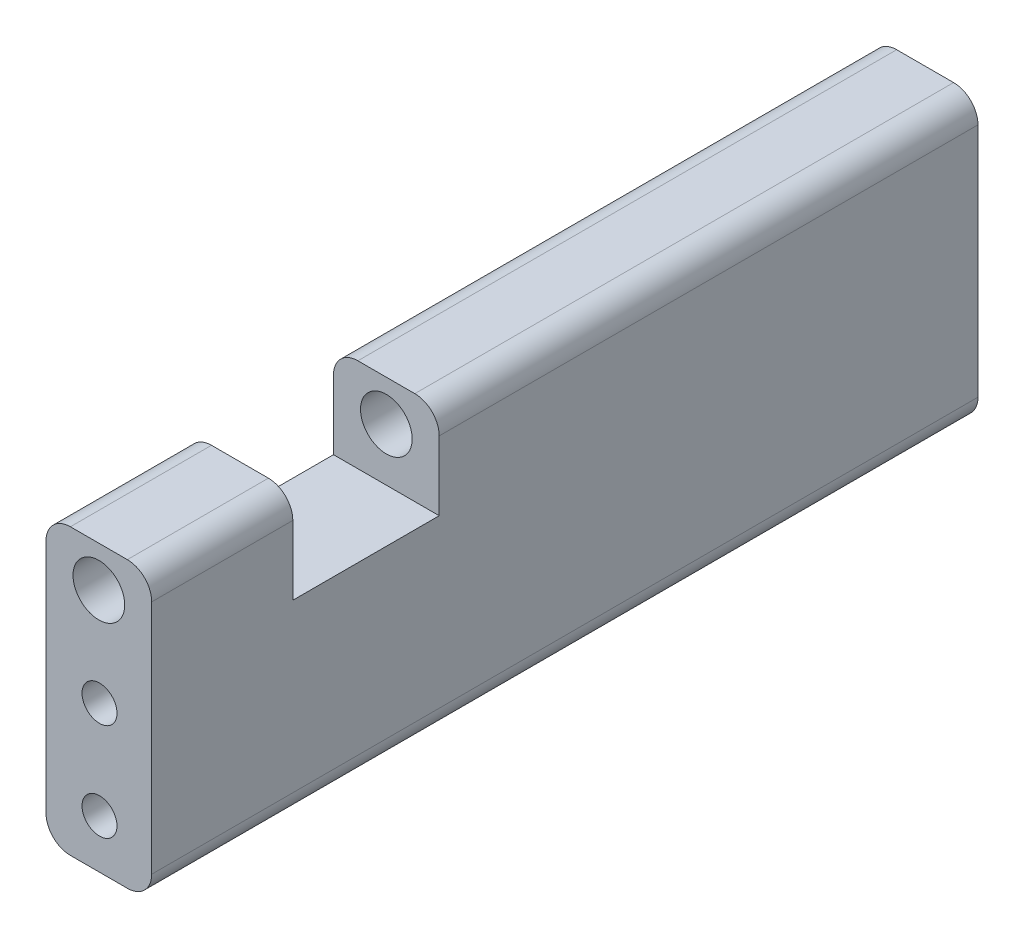
ISO-10303-21;
HEADER;
FILE_DESCRIPTION(('STEP AP214'),'2;1');
FILE_NAME('part.step','',(''),(''),'','','');
FILE_SCHEMA(('AUTOMOTIVE_DESIGN { 1 0 10303 214 1 1 1 1 }'));
ENDSEC;
DATA;
#1=APPLICATION_CONTEXT('core data for automotive mechanical design processes');
#2=APPLICATION_PROTOCOL_DEFINITION('international standard','automotive_design',2000,#1);
#3=PRODUCT_CONTEXT('',#1,'mechanical');
#4=PRODUCT('Part','Part','',(#3));
#5=PRODUCT_RELATED_PRODUCT_CATEGORY('part','',(#4));
#6=PRODUCT_DEFINITION_FORMATION('','',#4);
#7=PRODUCT_DEFINITION_CONTEXT('part definition',#1,'design');
#8=PRODUCT_DEFINITION('design','',#6,#7);
#9=PRODUCT_DEFINITION_SHAPE('','',#8);
#10=(LENGTH_UNIT() NAMED_UNIT(*) SI_UNIT(.MILLI.,.METRE.));
#11=(NAMED_UNIT(*) PLANE_ANGLE_UNIT() SI_UNIT($,.RADIAN.));
#12=(NAMED_UNIT(*) SI_UNIT($,.STERADIAN.) SOLID_ANGLE_UNIT());
#13=UNCERTAINTY_MEASURE_WITH_UNIT(LENGTH_MEASURE(1.E-05),#10,'distance_accuracy_value','');
#14=(GEOMETRIC_REPRESENTATION_CONTEXT(3) GLOBAL_UNCERTAINTY_ASSIGNED_CONTEXT((#13)) GLOBAL_UNIT_ASSIGNED_CONTEXT((#10,
#11,#12)) REPRESENTATION_CONTEXT('',''));
#15=CARTESIAN_POINT('',(0.,0.,0.));
#16=DIRECTION('',(0.,0.,1.));
#17=DIRECTION('',(1.,0.,0.));
#18=AXIS2_PLACEMENT_3D('',#15,#16,#17);
#19=CARTESIAN_POINT('',(0.,35.,101.6));
#20=DIRECTION('',(0.,-1.,0.));
#21=DIRECTION('',(0.,0.,-1.));
#22=AXIS2_PLACEMENT_3D('',#19,#20,#21);
#23=PLANE('',#22);
#24=DIRECTION('',(-1.,0.,0.));
#25=VECTOR('',#24,1.);
#26=CARTESIAN_POINT('',(0.,35.,84.25));
#27=LINE('',#26,#25);
#28=CARTESIAN_POINT('',(9.99999999999999,35.,84.25));
#29=VERTEX_POINT('',#28);
#30=CARTESIAN_POINT('',(3.,35.,84.25));
#31=VERTEX_POINT('',#30);
#32=EDGE_CURVE('E215',#29,#31,#27,.T.);
#33=ORIENTED_EDGE('',*,*,#32,.T.);
#34=DIRECTION('',(0.,0.,-1.));
#35=VECTOR('',#34,1.);
#36=CARTESIAN_POINT('',(3.,35.,101.6));
#37=LINE('',#36,#35);
#38=CARTESIAN_POINT('',(3.,35.,101.6));
#39=VERTEX_POINT('',#38);
#40=EDGE_CURVE('E340',#31,#39,#37,.F.);
#41=ORIENTED_EDGE('',*,*,#40,.T.);
#42=DIRECTION('',(-1.,0.,0.));
#43=VECTOR('',#42,1.);
#44=CARTESIAN_POINT('',(0.,35.,101.6));
#45=LINE('',#44,#43);
#46=CARTESIAN_POINT('',(9.99999999999999,35.,101.6));
#47=VERTEX_POINT('',#46);
#48=EDGE_CURVE('E255',#47,#39,#45,.T.);
#49=ORIENTED_EDGE('',*,*,#48,.F.);
#50=DIRECTION('',(0.,0.,-1.));
#51=VECTOR('',#50,1.);
#52=CARTESIAN_POINT('',(10.,35.,101.6));
#53=LINE('',#52,#51);
#54=EDGE_CURVE('E336',#47,#29,#53,.T.);
#55=ORIENTED_EDGE('',*,*,#54,.T.);
#56=EDGE_LOOP('',(#33,#41,#49,#55));
#57=FACE_BOUND('',#56,.T.);
#58=ADVANCED_FACE('F42',(#57),#23,.F.);
#59=CARTESIAN_POINT('',(6.5,30.,101.6));
#60=DIRECTION('',(0.,0.,-1.));
#61=DIRECTION('',(-1.,0.,0.));
#62=AXIS2_PLACEMENT_3D('',#59,#60,#61);
#63=CYLINDRICAL_SURFACE('',#62,3.175);
#64=CARTESIAN_POINT('',(6.5,30.,101.6));
#65=DIRECTION('',(0.,0.,1.));
#66=DIRECTION('',(1.,0.,0.));
#67=AXIS2_PLACEMENT_3D('',#64,#65,#66);
#68=CIRCLE('',#67,3.175);
#69=CARTESIAN_POINT('',(9.675,30.,101.6));
#70=VERTEX_POINT('',#69);
#71=EDGE_CURVE('E232',#70,#70,#68,.T.);
#72=ORIENTED_EDGE('',*,*,#71,.T.);
#73=EDGE_LOOP('',(#72));
#74=FACE_BOUND('',#73,.T.);
#75=CARTESIAN_POINT('',(6.5,30.,84.25));
#76=DIRECTION('',(0.,0.,-1.));
#77=DIRECTION('',(-1.,0.,0.));
#78=AXIS2_PLACEMENT_3D('',#75,#76,#77);
#79=CIRCLE('',#78,3.175);
#80=CARTESIAN_POINT('',(3.325,30.,84.25));
#81=VERTEX_POINT('',#80);
#82=EDGE_CURVE('E228',#81,#81,#79,.T.);
#83=ORIENTED_EDGE('',*,*,#82,.T.);
#84=EDGE_LOOP('',(#83));
#85=FACE_BOUND('',#84,.T.);
#86=ADVANCED_FACE('F385',(#74,#85),#63,.F.);
#87=CARTESIAN_POINT('',(0.,0.,101.6));
#88=DIRECTION('',(0.,0.,-1.));
#89=DIRECTION('',(-1.,0.,0.));
#90=AXIS2_PLACEMENT_3D('',#87,#88,#89);
#91=PLANE('',#90);
#92=CARTESIAN_POINT('',(6.57924630166814,18.,101.6));
#93=DIRECTION('',(0.,0.,1.));
#94=DIRECTION('',(1.,0.,0.));
#95=AXIS2_PLACEMENT_3D('',#92,#93,#94);
#96=CIRCLE('',#95,2.14999999999999);
#97=CARTESIAN_POINT('',(8.72924630166813,18.,101.6));
#98=VERTEX_POINT('',#97);
#99=EDGE_CURVE('E166',#98,#98,#96,.T.);
#100=ORIENTED_EDGE('',*,*,#99,.F.);
#101=EDGE_LOOP('',(#100));
#102=FACE_BOUND('',#101,.T.);
#103=CARTESIAN_POINT('',(6.57924630166814,6.,101.6));
#104=DIRECTION('',(0.,0.,1.));
#105=DIRECTION('',(1.,0.,0.));
#106=AXIS2_PLACEMENT_3D('',#103,#104,#105);
#107=CIRCLE('',#106,2.14999999999999);
#108=CARTESIAN_POINT('',(8.72924630166813,6.,101.6));
#109=VERTEX_POINT('',#108);
#110=EDGE_CURVE('E165',#109,#109,#107,.T.);
#111=ORIENTED_EDGE('',*,*,#110,.F.);
#112=EDGE_LOOP('',(#111));
#113=FACE_BOUND('',#112,.T.);
#114=DIRECTION('',(0.,-1.,0.));
#115=VECTOR('',#114,1.);
#116=CARTESIAN_POINT('',(0.,0.,101.6));
#117=LINE('',#116,#115);
#118=CARTESIAN_POINT('',(0.,32.,101.6));
#119=VERTEX_POINT('',#118);
#120=CARTESIAN_POINT('',(0.,3.,101.6));
#121=VERTEX_POINT('',#120);
#122=EDGE_CURVE('E242',#119,#121,#117,.T.);
#123=ORIENTED_EDGE('',*,*,#122,.T.);
#124=CARTESIAN_POINT('',(3.,3.,101.6));
#125=DIRECTION('',(0.,0.,-1.));
#126=DIRECTION('',(-1.,0.,0.));
#127=AXIS2_PLACEMENT_3D('',#124,#125,#126);
#128=CIRCLE('',#127,3.);
#129=CARTESIAN_POINT('',(3.,0.,101.6));
#130=VERTEX_POINT('',#129);
#131=EDGE_CURVE('E317',#121,#130,#128,.F.);
#132=ORIENTED_EDGE('',*,*,#131,.T.);
#133=DIRECTION('',(1.,0.,0.));
#134=VECTOR('',#133,1.);
#135=CARTESIAN_POINT('',(0.,0.,101.6));
#136=LINE('',#135,#134);
#137=CARTESIAN_POINT('',(9.99999999999999,0.,101.6));
#138=VERTEX_POINT('',#137);
#139=EDGE_CURVE('E246',#130,#138,#136,.T.);
#140=ORIENTED_EDGE('',*,*,#139,.T.);
#141=CARTESIAN_POINT('',(10.,3.,101.6));
#142=DIRECTION('',(0.,0.,-1.));
#143=DIRECTION('',(-1.,0.,0.));
#144=AXIS2_PLACEMENT_3D('',#141,#142,#143);
#145=CIRCLE('',#144,3.);
#146=CARTESIAN_POINT('',(13.,3.,101.6));
#147=VERTEX_POINT('',#146);
#148=EDGE_CURVE('E314',#138,#147,#145,.F.);
#149=ORIENTED_EDGE('',*,*,#148,.T.);
#150=DIRECTION('',(0.,1.,0.));
#151=VECTOR('',#150,1.);
#152=CARTESIAN_POINT('',(13.,0.,101.6));
#153=LINE('',#152,#151);
#154=CARTESIAN_POINT('',(13.,32.,101.6));
#155=VERTEX_POINT('',#154);
#156=EDGE_CURVE('E251',#147,#155,#153,.T.);
#157=ORIENTED_EDGE('',*,*,#156,.T.);
#158=CARTESIAN_POINT('',(10.,32.,101.6));
#159=DIRECTION('',(0.,0.,-1.));
#160=DIRECTION('',(-1.,0.,0.));
#161=AXIS2_PLACEMENT_3D('',#158,#159,#160);
#162=CIRCLE('',#161,3.);
#163=EDGE_CURVE('E308',#155,#47,#162,.F.);
#164=ORIENTED_EDGE('',*,*,#163,.T.);
#165=ORIENTED_EDGE('',*,*,#48,.T.);
#166=CARTESIAN_POINT('',(3.,32.,101.6));
#167=DIRECTION('',(0.,0.,-1.));
#168=DIRECTION('',(-1.,0.,0.));
#169=AXIS2_PLACEMENT_3D('',#166,#167,#168);
#170=CIRCLE('',#169,3.);
#171=EDGE_CURVE('E311',#39,#119,#170,.F.);
#172=ORIENTED_EDGE('',*,*,#171,.T.);
#173=EDGE_LOOP('',(#123,#132,#140,#149,#157,#164,#165,#172));
#174=FACE_BOUND('',#173,.T.);
#175=ORIENTED_EDGE('',*,*,#71,.F.);
#176=EDGE_LOOP('',(#175));
#177=FACE_BOUND('',#176,.T.);
#178=ADVANCED_FACE('F391',(#102,#113,#174,#177),#91,.F.);
#179=CARTESIAN_POINT('',(0.,0.,0.));
#180=DIRECTION('',(0.,0.,-1.));
#181=DIRECTION('',(-1.,0.,0.));
#182=AXIS2_PLACEMENT_3D('',#179,#180,#181);
#183=PLANE('',#182);
#184=CARTESIAN_POINT('',(6.57924630166814,18.,0.));
#185=DIRECTION('',(0.,0.,-1.));
#186=DIRECTION('',(-1.,0.,0.));
#187=AXIS2_PLACEMENT_3D('',#184,#185,#186);
#188=CIRCLE('',#187,2.14999999999999);
#189=CARTESIAN_POINT('',(4.42924630166815,18.,0.));
#190=VERTEX_POINT('',#189);
#191=EDGE_CURVE('E180',#190,#190,#188,.T.);
#192=ORIENTED_EDGE('',*,*,#191,.F.);
#193=EDGE_LOOP('',(#192));
#194=FACE_BOUND('',#193,.T.);
#195=CARTESIAN_POINT('',(6.57924630166814,6.,0.));
#196=DIRECTION('',(0.,0.,-1.));
#197=DIRECTION('',(-1.,0.,0.));
#198=AXIS2_PLACEMENT_3D('',#195,#196,#197);
#199=CIRCLE('',#198,2.14999999999999);
#200=CARTESIAN_POINT('',(4.42924630166815,6.,0.));
#201=VERTEX_POINT('',#200);
#202=EDGE_CURVE('E188',#201,#201,#199,.T.);
#203=ORIENTED_EDGE('',*,*,#202,.F.);
#204=EDGE_LOOP('',(#203));
#205=FACE_BOUND('',#204,.T.);
#206=DIRECTION('',(1.,0.,0.));
#207=VECTOR('',#206,1.);
#208=CARTESIAN_POINT('',(0.,0.,0.));
#209=LINE('',#208,#207);
#210=CARTESIAN_POINT('',(3.,0.,0.));
#211=VERTEX_POINT('',#210);
#212=CARTESIAN_POINT('',(9.99999999999999,0.,0.));
#213=VERTEX_POINT('',#212);
#214=EDGE_CURVE('E263',#211,#213,#209,.T.);
#215=ORIENTED_EDGE('',*,*,#214,.F.);
#216=CARTESIAN_POINT('',(3.,3.,0.));
#217=DIRECTION('',(0.,0.,-1.));
#218=DIRECTION('',(-1.,0.,0.));
#219=AXIS2_PLACEMENT_3D('',#216,#217,#218);
#220=CIRCLE('',#219,3.);
#221=CARTESIAN_POINT('',(0.,3.,0.));
#222=VERTEX_POINT('',#221);
#223=EDGE_CURVE('E294',#211,#222,#220,.T.);
#224=ORIENTED_EDGE('',*,*,#223,.T.);
#225=DIRECTION('',(0.,-1.,0.));
#226=VECTOR('',#225,1.);
#227=CARTESIAN_POINT('',(0.,0.,0.));
#228=LINE('',#227,#226);
#229=CARTESIAN_POINT('',(0.,32.,0.));
#230=VERTEX_POINT('',#229);
#231=EDGE_CURVE('E236',#230,#222,#228,.T.);
#232=ORIENTED_EDGE('',*,*,#231,.F.);
#233=CARTESIAN_POINT('',(3.,32.,0.));
#234=DIRECTION('',(0.,0.,-1.));
#235=DIRECTION('',(-1.,0.,0.));
#236=AXIS2_PLACEMENT_3D('',#233,#234,#235);
#237=CIRCLE('',#236,3.);
#238=CARTESIAN_POINT('',(3.,35.,0.));
#239=VERTEX_POINT('',#238);
#240=EDGE_CURVE('E288',#230,#239,#237,.T.);
#241=ORIENTED_EDGE('',*,*,#240,.T.);
#242=DIRECTION('',(-1.,0.,0.));
#243=VECTOR('',#242,1.);
#244=CARTESIAN_POINT('',(0.,35.,0.));
#245=LINE('',#244,#243);
#246=CARTESIAN_POINT('',(9.99999999999999,35.,0.));
#247=VERTEX_POINT('',#246);
#248=EDGE_CURVE('E247',#247,#239,#245,.T.);
#249=ORIENTED_EDGE('',*,*,#248,.F.);
#250=CARTESIAN_POINT('',(10.,32.,0.));
#251=DIRECTION('',(0.,0.,-1.));
#252=DIRECTION('',(-1.,0.,0.));
#253=AXIS2_PLACEMENT_3D('',#250,#251,#252);
#254=CIRCLE('',#253,3.);
#255=CARTESIAN_POINT('',(13.,32.,0.));
#256=VERTEX_POINT('',#255);
#257=EDGE_CURVE('E285',#247,#256,#254,.T.);
#258=ORIENTED_EDGE('',*,*,#257,.T.);
#259=DIRECTION('',(0.,1.,0.));
#260=VECTOR('',#259,1.);
#261=CARTESIAN_POINT('',(13.,0.,0.));
#262=LINE('',#261,#260);
#263=CARTESIAN_POINT('',(13.,3.,0.));
#264=VERTEX_POINT('',#263);
#265=EDGE_CURVE('E267',#264,#256,#262,.T.);
#266=ORIENTED_EDGE('',*,*,#265,.F.);
#267=CARTESIAN_POINT('',(10.,3.,0.));
#268=DIRECTION('',(0.,0.,-1.));
#269=DIRECTION('',(-1.,0.,0.));
#270=AXIS2_PLACEMENT_3D('',#267,#268,#269);
#271=CIRCLE('',#270,3.);
#272=EDGE_CURVE('E291',#264,#213,#271,.T.);
#273=ORIENTED_EDGE('',*,*,#272,.T.);
#274=EDGE_LOOP('',(#215,#224,#232,#241,#249,#258,#266,#273));
#275=FACE_BOUND('',#274,.T.);
#276=CARTESIAN_POINT('',(6.5,30.,0.));
#277=DIRECTION('',(0.,0.,1.));
#278=DIRECTION('',(1.,0.,0.));
#279=AXIS2_PLACEMENT_3D('',#276,#277,#278);
#280=CIRCLE('',#279,3.175);
#281=CARTESIAN_POINT('',(9.675,30.,0.));
#282=VERTEX_POINT('',#281);
#283=EDGE_CURVE('E237',#282,#282,#280,.T.);
#284=ORIENTED_EDGE('',*,*,#283,.T.);
#285=EDGE_LOOP('',(#284));
#286=FACE_BOUND('',#285,.T.);
#287=ADVANCED_FACE('F355',(#194,#205,#275,#286),#183,.T.);
#288=CARTESIAN_POINT('',(0.,0.,101.6));
#289=DIRECTION('',(1.,0.,0.));
#290=DIRECTION('',(0.,0.,-1.));
#291=AXIS2_PLACEMENT_3D('',#288,#289,#290);
#292=PLANE('',#291);
#293=ORIENTED_EDGE('',*,*,#231,.T.);
#294=DIRECTION('',(0.,0.,-1.));
#295=VECTOR('',#294,1.);
#296=CARTESIAN_POINT('',(0.,3.,101.6));
#297=LINE('',#296,#295);
#298=EDGE_CURVE('E305',#222,#121,#297,.F.);
#299=ORIENTED_EDGE('',*,*,#298,.T.);
#300=ORIENTED_EDGE('',*,*,#122,.F.);
#301=DIRECTION('',(0.,0.,-1.));
#302=VECTOR('',#301,1.);
#303=CARTESIAN_POINT('',(0.,32.,101.6));
#304=LINE('',#303,#302);
#305=CARTESIAN_POINT('',(0.,32.,84.25));
#306=VERTEX_POINT('',#305);
#307=EDGE_CURVE('E301',#119,#306,#304,.T.);
#308=ORIENTED_EDGE('',*,*,#307,.T.);
#309=DIRECTION('',(0.,-1.,0.));
#310=VECTOR('',#309,1.);
#311=CARTESIAN_POINT('',(0.,30.,84.25));
#312=LINE('',#311,#310);
#313=CARTESIAN_POINT('',(0.,23.5,84.25));
#314=VERTEX_POINT('',#313);
#315=EDGE_CURVE('E219',#306,#314,#312,.T.);
#316=ORIENTED_EDGE('',*,*,#315,.T.);
#317=DIRECTION('',(0.,0.,1.));
#318=VECTOR('',#317,1.);
#319=CARTESIAN_POINT('',(0.,23.5,66.25));
#320=LINE('',#319,#318);
#321=CARTESIAN_POINT('',(0.,23.5,66.25));
#322=VERTEX_POINT('',#321);
#323=EDGE_CURVE('E211',#322,#314,#320,.T.);
#324=ORIENTED_EDGE('',*,*,#323,.F.);
#325=DIRECTION('',(0.,-1.,0.));
#326=VECTOR('',#325,1.);
#327=CARTESIAN_POINT('',(0.,30.,66.25));
#328=LINE('',#327,#326);
#329=CARTESIAN_POINT('',(0.,32.,66.25));
#330=VERTEX_POINT('',#329);
#331=EDGE_CURVE('E204',#330,#322,#328,.T.);
#332=ORIENTED_EDGE('',*,*,#331,.F.);
#333=DIRECTION('',(0.,0.,-1.));
#334=VECTOR('',#333,1.);
#335=CARTESIAN_POINT('',(0.,32.,101.6));
#336=LINE('',#335,#334);
#337=EDGE_CURVE('E297',#330,#230,#336,.T.);
#338=ORIENTED_EDGE('',*,*,#337,.T.);
#339=EDGE_LOOP('',(#293,#299,#300,#308,#316,#324,#332,#338));
#340=FACE_BOUND('',#339,.T.);
#341=ADVANCED_FACE('F365',(#340),#292,.F.);
#342=CARTESIAN_POINT('',(0.,0.,101.6));
#343=DIRECTION('',(0.,1.,0.));
#344=DIRECTION('',(0.,0.,1.));
#345=AXIS2_PLACEMENT_3D('',#342,#343,#344);
#346=PLANE('',#345);
#347=ORIENTED_EDGE('',*,*,#139,.F.);
#348=DIRECTION('',(0.,0.,-1.));
#349=VECTOR('',#348,1.);
#350=CARTESIAN_POINT('',(3.,0.,101.6));
#351=LINE('',#350,#349);
#352=EDGE_CURVE('E281',#130,#211,#351,.T.);
#353=ORIENTED_EDGE('',*,*,#352,.T.);
#354=ORIENTED_EDGE('',*,*,#214,.T.);
#355=DIRECTION('',(0.,0.,-1.));
#356=VECTOR('',#355,1.);
#357=CARTESIAN_POINT('',(10.,0.,101.6));
#358=LINE('',#357,#356);
#359=EDGE_CURVE('E259',#213,#138,#358,.F.);
#360=ORIENTED_EDGE('',*,*,#359,.T.);
#361=EDGE_LOOP('',(#347,#353,#354,#360));
#362=FACE_BOUND('',#361,.T.);
#363=ADVANCED_FACE('F403',(#362),#346,.F.);
#364=CARTESIAN_POINT('',(13.,0.,101.6));
#365=DIRECTION('',(-1.,0.,0.));
#366=DIRECTION('',(0.,0.,1.));
#367=AXIS2_PLACEMENT_3D('',#364,#365,#366);
#368=PLANE('',#367);
#369=ORIENTED_EDGE('',*,*,#156,.F.);
#370=DIRECTION('',(0.,0.,-1.));
#371=VECTOR('',#370,1.);
#372=CARTESIAN_POINT('',(13.,3.,101.6));
#373=LINE('',#372,#371);
#374=EDGE_CURVE('E326',#147,#264,#373,.T.);
#375=ORIENTED_EDGE('',*,*,#374,.T.);
#376=ORIENTED_EDGE('',*,*,#265,.T.);
#377=DIRECTION('',(0.,0.,-1.));
#378=VECTOR('',#377,1.);
#379=CARTESIAN_POINT('',(13.,32.,101.6));
#380=LINE('',#379,#378);
#381=CARTESIAN_POINT('',(13.,32.,66.25));
#382=VERTEX_POINT('',#381);
#383=EDGE_CURVE('E320',#256,#382,#380,.F.);
#384=ORIENTED_EDGE('',*,*,#383,.T.);
#385=DIRECTION('',(0.,1.,0.));
#386=VECTOR('',#385,1.);
#387=CARTESIAN_POINT('',(13.,23.5,66.25));
#388=LINE('',#387,#386);
#389=CARTESIAN_POINT('',(13.,23.5,66.25));
#390=VERTEX_POINT('',#389);
#391=EDGE_CURVE('E197',#390,#382,#388,.T.);
#392=ORIENTED_EDGE('',*,*,#391,.F.);
#393=DIRECTION('',(0.,0.,1.));
#394=VECTOR('',#393,1.);
#395=CARTESIAN_POINT('',(13.,23.5,66.25));
#396=LINE('',#395,#394);
#397=CARTESIAN_POINT('',(13.,23.5,84.25));
#398=VERTEX_POINT('',#397);
#399=EDGE_CURVE('E224',#390,#398,#396,.T.);
#400=ORIENTED_EDGE('',*,*,#399,.T.);
#401=DIRECTION('',(0.,1.,0.));
#402=VECTOR('',#401,1.);
#403=CARTESIAN_POINT('',(13.,35.,84.25));
#404=LINE('',#403,#402);
#405=CARTESIAN_POINT('',(13.,32.,84.25));
#406=VERTEX_POINT('',#405);
#407=EDGE_CURVE('E196',#398,#406,#404,.T.);
#408=ORIENTED_EDGE('',*,*,#407,.T.);
#409=DIRECTION('',(0.,0.,-1.));
#410=VECTOR('',#409,1.);
#411=CARTESIAN_POINT('',(13.,32.,101.6));
#412=LINE('',#411,#410);
#413=EDGE_CURVE('E323',#406,#155,#412,.F.);
#414=ORIENTED_EDGE('',*,*,#413,.T.);
#415=EDGE_LOOP('',(#369,#375,#376,#384,#392,#400,#408,#414));
#416=FACE_BOUND('',#415,.T.);
#417=ADVANCED_FACE('F376',(#416),#368,.F.);
#418=ORIENTED_EDGE('',*,*,#248,.T.);
#419=DIRECTION('',(0.,0.,-1.));
#420=VECTOR('',#419,1.);
#421=CARTESIAN_POINT('',(3.,35.,101.6));
#422=LINE('',#421,#420);
#423=CARTESIAN_POINT('',(3.,35.,66.25));
#424=VERTEX_POINT('',#423);
#425=EDGE_CURVE('E58',#239,#424,#422,.F.);
#426=ORIENTED_EDGE('',*,*,#425,.T.);
#427=DIRECTION('',(-1.,0.,0.));
#428=VECTOR('',#427,1.);
#429=CARTESIAN_POINT('',(0.,35.,66.25));
#430=LINE('',#429,#428);
#431=CARTESIAN_POINT('',(9.99999999999999,35.,66.25));
#432=VERTEX_POINT('',#431);
#433=EDGE_CURVE('E200',#432,#424,#430,.T.);
#434=ORIENTED_EDGE('',*,*,#433,.F.);
#435=DIRECTION('',(0.,0.,-1.));
#436=VECTOR('',#435,1.);
#437=CARTESIAN_POINT('',(10.,35.,101.6));
#438=LINE('',#437,#436);
#439=EDGE_CURVE('E343',#432,#247,#438,.T.);
#440=ORIENTED_EDGE('',*,*,#439,.T.);
#441=EDGE_LOOP('',(#418,#426,#434,#440));
#442=FACE_BOUND('',#441,.T.);
#443=ADVANCED_FACE('F351',(#442),#23,.F.);
#444=CARTESIAN_POINT('',(6.5,30.,66.25));
#445=DIRECTION('',(0.,0.,-1.));
#446=DIRECTION('',(-1.,0.,0.));
#447=AXIS2_PLACEMENT_3D('',#444,#445,#446);
#448=CIRCLE('',#447,3.175);
#449=CARTESIAN_POINT('',(3.325,30.,66.25));
#450=VERTEX_POINT('',#449);
#451=EDGE_CURVE('E241',#450,#450,#448,.T.);
#452=ORIENTED_EDGE('',*,*,#451,.F.);
#453=EDGE_LOOP('',(#452));
#454=FACE_BOUND('',#453,.T.);
#455=ORIENTED_EDGE('',*,*,#283,.F.);
#456=EDGE_LOOP('',(#455));
#457=FACE_BOUND('',#456,.T.);
#458=ADVANCED_FACE('F394',(#454,#457),#63,.F.);
#459=CARTESIAN_POINT('',(0.,23.5,66.25));
#460=DIRECTION('',(0.,-1.,0.));
#461=DIRECTION('',(0.,0.,-1.));
#462=AXIS2_PLACEMENT_3D('',#459,#460,#461);
#463=PLANE('',#462);
#464=DIRECTION('',(1.,0.,0.));
#465=VECTOR('',#464,1.);
#466=CARTESIAN_POINT('',(0.,23.5,84.25));
#467=LINE('',#466,#465);
#468=EDGE_CURVE('E201',#314,#398,#467,.T.);
#469=ORIENTED_EDGE('',*,*,#468,.T.);
#470=ORIENTED_EDGE('',*,*,#399,.F.);
#471=DIRECTION('',(1.,0.,0.));
#472=VECTOR('',#471,1.);
#473=CARTESIAN_POINT('',(0.,23.5,66.25));
#474=LINE('',#473,#472);
#475=EDGE_CURVE('E207',#322,#390,#474,.T.);
#476=ORIENTED_EDGE('',*,*,#475,.F.);
#477=ORIENTED_EDGE('',*,*,#323,.T.);
#478=EDGE_LOOP('',(#469,#470,#476,#477));
#479=FACE_BOUND('',#478,.T.);
#480=ADVANCED_FACE('F372',(#479),#463,.F.);
#481=CARTESIAN_POINT('',(0.,0.,66.25));
#482=DIRECTION('',(0.,0.,-1.));
#483=DIRECTION('',(-1.,0.,0.));
#484=AXIS2_PLACEMENT_3D('',#481,#482,#483);
#485=PLANE('',#484);
#486=ORIENTED_EDGE('',*,*,#451,.T.);
#487=EDGE_LOOP('',(#486));
#488=FACE_BOUND('',#487,.T.);
#489=ORIENTED_EDGE('',*,*,#433,.T.);
#490=CARTESIAN_POINT('',(3.,32.,66.25));
#491=DIRECTION('',(0.,0.,-1.));
#492=DIRECTION('',(-1.,0.,0.));
#493=AXIS2_PLACEMENT_3D('',#490,#491,#492);
#494=CIRCLE('',#493,3.);
#495=EDGE_CURVE('E11',#424,#330,#494,.F.);
#496=ORIENTED_EDGE('',*,*,#495,.T.);
#497=ORIENTED_EDGE('',*,*,#331,.T.);
#498=ORIENTED_EDGE('',*,*,#475,.T.);
#499=ORIENTED_EDGE('',*,*,#391,.T.);
#500=CARTESIAN_POINT('',(10.,32.,66.25));
#501=DIRECTION('',(0.,0.,-1.));
#502=DIRECTION('',(-1.,0.,0.));
#503=AXIS2_PLACEMENT_3D('',#500,#501,#502);
#504=CIRCLE('',#503,3.);
#505=EDGE_CURVE('E51',#382,#432,#504,.F.);
#506=ORIENTED_EDGE('',*,*,#505,.T.);
#507=EDGE_LOOP('',(#489,#496,#497,#498,#499,#506));
#508=FACE_BOUND('',#507,.T.);
#509=ADVANCED_FACE('F369',(#488,#508),#485,.F.);
#510=CARTESIAN_POINT('',(0.,0.,84.25));
#511=DIRECTION('',(0.,0.,-1.));
#512=DIRECTION('',(-1.,0.,0.));
#513=AXIS2_PLACEMENT_3D('',#510,#511,#512);
#514=PLANE('',#513);
#515=ORIENTED_EDGE('',*,*,#82,.F.);
#516=EDGE_LOOP('',(#515));
#517=FACE_BOUND('',#516,.T.);
#518=ORIENTED_EDGE('',*,*,#315,.F.);
#519=CARTESIAN_POINT('',(3.,32.,84.25));
#520=DIRECTION('',(0.,0.,-1.));
#521=DIRECTION('',(-1.,0.,0.));
#522=AXIS2_PLACEMENT_3D('',#519,#520,#521);
#523=CIRCLE('',#522,3.);
#524=EDGE_CURVE('E333',#306,#31,#523,.T.);
#525=ORIENTED_EDGE('',*,*,#524,.T.);
#526=ORIENTED_EDGE('',*,*,#32,.F.);
#527=CARTESIAN_POINT('',(10.,32.,84.25));
#528=DIRECTION('',(0.,0.,-1.));
#529=DIRECTION('',(-1.,0.,0.));
#530=AXIS2_PLACEMENT_3D('',#527,#528,#529);
#531=CIRCLE('',#530,3.);
#532=EDGE_CURVE('E330',#29,#406,#531,.T.);
#533=ORIENTED_EDGE('',*,*,#532,.T.);
#534=ORIENTED_EDGE('',*,*,#407,.F.);
#535=ORIENTED_EDGE('',*,*,#468,.F.);
#536=EDGE_LOOP('',(#518,#525,#526,#533,#534,#535));
#537=FACE_BOUND('',#536,.T.);
#538=ADVANCED_FACE('F446',(#517,#537),#514,.T.);
#539=CARTESIAN_POINT('',(6.57924630166814,6.,5.));
#540=DIRECTION('',(0.,0.,-1.));
#541=DIRECTION('',(-1.,0.,0.));
#542=AXIS2_PLACEMENT_3D('',#539,#540,#541);
#543=CONICAL_SURFACE('',#542,2.14999999999999,1.02974425867665);
#544=CARTESIAN_POINT('',(6.57924630166814,6.,6.29185033090925));
#545=VERTEX_POINT('',#544);
#546=VERTEX_LOOP('',#545);
#547=FACE_BOUND('',#546,.T.);
#548=CARTESIAN_POINT('',(6.57924630166814,6.,5.));
#549=DIRECTION('',(0.,0.,-1.));
#550=DIRECTION('',(-1.,0.,0.));
#551=AXIS2_PLACEMENT_3D('',#548,#549,#550);
#552=CIRCLE('',#551,2.14999999999999);
#553=CARTESIAN_POINT('',(4.42924630166815,6.,5.));
#554=VERTEX_POINT('',#553);
#555=EDGE_CURVE('E192',#554,#554,#552,.T.);
#556=ORIENTED_EDGE('',*,*,#555,.T.);
#557=EDGE_LOOP('',(#556));
#558=FACE_BOUND('',#557,.T.);
#559=ADVANCED_FACE('F448',(#547,#558),#543,.F.);
#560=CARTESIAN_POINT('',(6.57924630166814,6.,0.));
#561=DIRECTION('',(0.,0.,-1.));
#562=DIRECTION('',(-1.,0.,0.));
#563=AXIS2_PLACEMENT_3D('',#560,#561,#562);
#564=CYLINDRICAL_SURFACE('',#563,2.14999999999999);
#565=ORIENTED_EDGE('',*,*,#555,.F.);
#566=EDGE_LOOP('',(#565));
#567=FACE_BOUND('',#566,.T.);
#568=ORIENTED_EDGE('',*,*,#202,.T.);
#569=EDGE_LOOP('',(#568));
#570=FACE_BOUND('',#569,.T.);
#571=ADVANCED_FACE('F455',(#567,#570),#564,.F.);
#572=CARTESIAN_POINT('',(6.57924630166814,18.,5.));
#573=DIRECTION('',(0.,0.,-1.));
#574=DIRECTION('',(-1.,0.,0.));
#575=AXIS2_PLACEMENT_3D('',#572,#573,#574);
#576=CONICAL_SURFACE('',#575,2.14999999999999,1.02974425867665);
#577=CARTESIAN_POINT('',(6.57924630166814,18.,6.29185033090925));
#578=VERTEX_POINT('',#577);
#579=VERTEX_LOOP('',#578);
#580=FACE_BOUND('',#579,.T.);
#581=CARTESIAN_POINT('',(6.57924630166814,18.,5.));
#582=DIRECTION('',(0.,0.,-1.));
#583=DIRECTION('',(-1.,0.,0.));
#584=AXIS2_PLACEMENT_3D('',#581,#582,#583);
#585=CIRCLE('',#584,2.14999999999999);
#586=CARTESIAN_POINT('',(4.42924630166815,18.,5.));
#587=VERTEX_POINT('',#586);
#588=EDGE_CURVE('E184',#587,#587,#585,.T.);
#589=ORIENTED_EDGE('',*,*,#588,.T.);
#590=EDGE_LOOP('',(#589));
#591=FACE_BOUND('',#590,.T.);
#592=ADVANCED_FACE('F475',(#580,#591),#576,.F.);
#593=CARTESIAN_POINT('',(6.57924630166814,18.,0.));
#594=DIRECTION('',(0.,0.,-1.));
#595=DIRECTION('',(-1.,0.,0.));
#596=AXIS2_PLACEMENT_3D('',#593,#594,#595);
#597=CYLINDRICAL_SURFACE('',#596,2.14999999999999);
#598=ORIENTED_EDGE('',*,*,#588,.F.);
#599=EDGE_LOOP('',(#598));
#600=FACE_BOUND('',#599,.T.);
#601=ORIENTED_EDGE('',*,*,#191,.T.);
#602=EDGE_LOOP('',(#601));
#603=FACE_BOUND('',#602,.T.);
#604=ADVANCED_FACE('F481',(#600,#603),#597,.F.);
#605=CARTESIAN_POINT('',(6.57924630166814,6.,96.6));
#606=DIRECTION('',(0.,0.,1.));
#607=DIRECTION('',(1.,0.,0.));
#608=AXIS2_PLACEMENT_3D('',#605,#606,#607);
#609=CONICAL_SURFACE('',#608,2.14999999999999,1.02974425867665);
#610=CARTESIAN_POINT('',(6.57924630166814,6.,95.3081496690907));
#611=VERTEX_POINT('',#610);
#612=VERTEX_LOOP('',#611);
#613=FACE_BOUND('',#612,.T.);
#614=CARTESIAN_POINT('',(6.57924630166814,6.,96.6));
#615=DIRECTION('',(0.,0.,1.));
#616=DIRECTION('',(1.,0.,0.));
#617=AXIS2_PLACEMENT_3D('',#614,#615,#616);
#618=CIRCLE('',#617,2.14999999999999);
#619=CARTESIAN_POINT('',(8.72924630166813,6.,96.6));
#620=VERTEX_POINT('',#619);
#621=EDGE_CURVE('E171',#620,#620,#618,.T.);
#622=ORIENTED_EDGE('',*,*,#621,.T.);
#623=EDGE_LOOP('',(#622));
#624=FACE_BOUND('',#623,.T.);
#625=ADVANCED_FACE('F488',(#613,#624),#609,.F.);
#626=CARTESIAN_POINT('',(6.57924630166814,6.,101.6));
#627=DIRECTION('',(0.,0.,1.));
#628=DIRECTION('',(1.,0.,0.));
#629=AXIS2_PLACEMENT_3D('',#626,#627,#628);
#630=CYLINDRICAL_SURFACE('',#629,2.14999999999999);
#631=ORIENTED_EDGE('',*,*,#621,.F.);
#632=EDGE_LOOP('',(#631));
#633=FACE_BOUND('',#632,.T.);
#634=ORIENTED_EDGE('',*,*,#110,.T.);
#635=EDGE_LOOP('',(#634));
#636=FACE_BOUND('',#635,.T.);
#637=ADVANCED_FACE('F158',(#633,#636),#630,.F.);
#638=CARTESIAN_POINT('',(6.57924630166814,18.,96.6));
#639=DIRECTION('',(0.,0.,1.));
#640=DIRECTION('',(1.,0.,0.));
#641=AXIS2_PLACEMENT_3D('',#638,#639,#640);
#642=CONICAL_SURFACE('',#641,2.14999999999999,1.02974425867665);
#643=CARTESIAN_POINT('',(6.57924630166814,18.,95.3081496690907));
#644=VERTEX_POINT('',#643);
#645=VERTEX_LOOP('',#644);
#646=FACE_BOUND('',#645,.T.);
#647=CARTESIAN_POINT('',(6.57924630166814,18.,96.6));
#648=DIRECTION('',(0.,0.,1.));
#649=DIRECTION('',(1.,0.,0.));
#650=AXIS2_PLACEMENT_3D('',#647,#648,#649);
#651=CIRCLE('',#650,2.14999999999999);
#652=CARTESIAN_POINT('',(8.72924630166813,18.,96.6));
#653=VERTEX_POINT('',#652);
#654=EDGE_CURVE('E162',#653,#653,#651,.T.);
#655=ORIENTED_EDGE('',*,*,#654,.T.);
#656=EDGE_LOOP('',(#655));
#657=FACE_BOUND('',#656,.T.);
#658=ADVANCED_FACE('F154',(#646,#657),#642,.F.);
#659=CARTESIAN_POINT('',(6.57924630166814,18.,101.6));
#660=DIRECTION('',(0.,0.,1.));
#661=DIRECTION('',(1.,0.,0.));
#662=AXIS2_PLACEMENT_3D('',#659,#660,#661);
#663=CYLINDRICAL_SURFACE('',#662,2.14999999999999);
#664=ORIENTED_EDGE('',*,*,#654,.F.);
#665=EDGE_LOOP('',(#664));
#666=FACE_BOUND('',#665,.T.);
#667=ORIENTED_EDGE('',*,*,#99,.T.);
#668=EDGE_LOOP('',(#667));
#669=FACE_BOUND('',#668,.T.);
#670=ADVANCED_FACE('F157',(#666,#669),#663,.F.);
#671=CARTESIAN_POINT('',(3.,3.,101.6));
#672=DIRECTION('',(0.,0.,-1.));
#673=DIRECTION('',(-1.,0.,0.));
#674=AXIS2_PLACEMENT_3D('',#671,#672,#673);
#675=CYLINDRICAL_SURFACE('',#674,3.);
#676=ORIENTED_EDGE('',*,*,#131,.F.);
#677=ORIENTED_EDGE('',*,*,#298,.F.);
#678=ORIENTED_EDGE('',*,*,#223,.F.);
#679=ORIENTED_EDGE('',*,*,#352,.F.);
#680=EDGE_LOOP('',(#676,#677,#678,#679));
#681=FACE_BOUND('',#680,.T.);
#682=ADVANCED_FACE('F412',(#681),#675,.T.);
#683=CARTESIAN_POINT('',(10.,3.,101.6));
#684=DIRECTION('',(0.,0.,-1.));
#685=DIRECTION('',(-1.,0.,0.));
#686=AXIS2_PLACEMENT_3D('',#683,#684,#685);
#687=CYLINDRICAL_SURFACE('',#686,3.);
#688=ORIENTED_EDGE('',*,*,#148,.F.);
#689=ORIENTED_EDGE('',*,*,#359,.F.);
#690=ORIENTED_EDGE('',*,*,#272,.F.);
#691=ORIENTED_EDGE('',*,*,#374,.F.);
#692=EDGE_LOOP('',(#688,#689,#690,#691));
#693=FACE_BOUND('',#692,.T.);
#694=ADVANCED_FACE('F415',(#693),#687,.T.);
#695=CARTESIAN_POINT('',(3.,32.,101.6));
#696=DIRECTION('',(0.,0.,-1.));
#697=DIRECTION('',(-1.,0.,0.));
#698=AXIS2_PLACEMENT_3D('',#695,#696,#697);
#699=CYLINDRICAL_SURFACE('',#698,3.);
#700=ORIENTED_EDGE('',*,*,#171,.F.);
#701=ORIENTED_EDGE('',*,*,#40,.F.);
#702=ORIENTED_EDGE('',*,*,#524,.F.);
#703=ORIENTED_EDGE('',*,*,#307,.F.);
#704=EDGE_LOOP('',(#700,#701,#702,#703));
#705=FACE_BOUND('',#704,.T.);
#706=ADVANCED_FACE('F419',(#705),#699,.T.);
#707=CARTESIAN_POINT('',(10.,32.,101.6));
#708=DIRECTION('',(0.,0.,-1.));
#709=DIRECTION('',(-1.,0.,0.));
#710=AXIS2_PLACEMENT_3D('',#707,#708,#709);
#711=CYLINDRICAL_SURFACE('',#710,3.);
#712=ORIENTED_EDGE('',*,*,#163,.F.);
#713=ORIENTED_EDGE('',*,*,#413,.F.);
#714=ORIENTED_EDGE('',*,*,#532,.F.);
#715=ORIENTED_EDGE('',*,*,#54,.F.);
#716=EDGE_LOOP('',(#712,#713,#714,#715));
#717=FACE_BOUND('',#716,.T.);
#718=ADVANCED_FACE('F383',(#717),#711,.T.);
#719=CARTESIAN_POINT('',(3.,32.,101.6));
#720=DIRECTION('',(0.,0.,-1.));
#721=DIRECTION('',(-1.,0.,0.));
#722=AXIS2_PLACEMENT_3D('',#719,#720,#721);
#723=CYLINDRICAL_SURFACE('',#722,3.);
#724=ORIENTED_EDGE('',*,*,#495,.F.);
#725=ORIENTED_EDGE('',*,*,#425,.F.);
#726=ORIENTED_EDGE('',*,*,#240,.F.);
#727=ORIENTED_EDGE('',*,*,#337,.F.);
#728=EDGE_LOOP('',(#724,#725,#726,#727));
#729=FACE_BOUND('',#728,.T.);
#730=ADVANCED_FACE('F362',(#729),#723,.T.);
#731=CARTESIAN_POINT('',(10.,32.,101.6));
#732=DIRECTION('',(0.,0.,-1.));
#733=DIRECTION('',(-1.,0.,0.));
#734=AXIS2_PLACEMENT_3D('',#731,#732,#733);
#735=CYLINDRICAL_SURFACE('',#734,3.);
#736=ORIENTED_EDGE('',*,*,#505,.F.);
#737=ORIENTED_EDGE('',*,*,#383,.F.);
#738=ORIENTED_EDGE('',*,*,#257,.F.);
#739=ORIENTED_EDGE('',*,*,#439,.F.);
#740=EDGE_LOOP('',(#736,#737,#738,#739));
#741=FACE_BOUND('',#740,.T.);
#742=ADVANCED_FACE('F44',(#741),#735,.T.);
#743=CLOSED_SHELL('',(#58,#86,#178,#287,#341,#363,#417,#443,#458,#480,#509,#538,#559,#571,#592,
#604,#625,#637,#658,#670,#682,#694,#706,#718,#730,#742));
#744=MANIFOLD_SOLID_BREP('B2',#743);
#745=ADVANCED_BREP_SHAPE_REPRESENTATION('',(#18,#744),#14);
#746=SHAPE_DEFINITION_REPRESENTATION(#9,#745);
ENDSEC;
END-ISO-10303-21;
